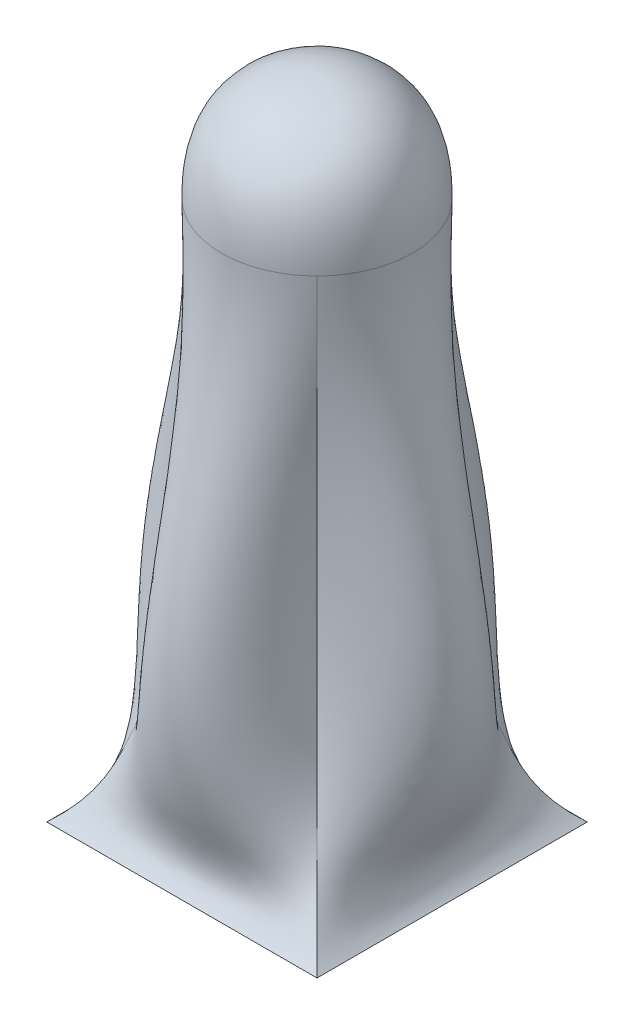
ISO-10303-21;
HEADER;
FILE_DESCRIPTION(('STEP AP214'),'2;1');
FILE_NAME('part.step','',(''),(''),'','','');
FILE_SCHEMA(('AUTOMOTIVE_DESIGN { 1 0 10303 214 1 1 1 1 }'));
ENDSEC;
DATA;
#1=APPLICATION_CONTEXT('core data for automotive mechanical design processes');
#2=APPLICATION_PROTOCOL_DEFINITION('international standard','automotive_design',2000,#1);
#3=PRODUCT_CONTEXT('',#1,'mechanical');
#4=PRODUCT('Part','Part','',(#3));
#5=PRODUCT_RELATED_PRODUCT_CATEGORY('part','',(#4));
#6=PRODUCT_DEFINITION_FORMATION('','',#4);
#7=PRODUCT_DEFINITION_CONTEXT('part definition',#1,'design');
#8=PRODUCT_DEFINITION('design','',#6,#7);
#9=PRODUCT_DEFINITION_SHAPE('','',#8);
#10=(LENGTH_UNIT() NAMED_UNIT(*) SI_UNIT(.MILLI.,.METRE.));
#11=(NAMED_UNIT(*) PLANE_ANGLE_UNIT() SI_UNIT($,.RADIAN.));
#12=(NAMED_UNIT(*) SI_UNIT($,.STERADIAN.) SOLID_ANGLE_UNIT());
#13=UNCERTAINTY_MEASURE_WITH_UNIT(LENGTH_MEASURE(1.E-05),#10,'distance_accuracy_value','');
#14=(GEOMETRIC_REPRESENTATION_CONTEXT(3) GLOBAL_UNCERTAINTY_ASSIGNED_CONTEXT((#13)) GLOBAL_UNIT_ASSIGNED_CONTEXT((#10,
#11,#12)) REPRESENTATION_CONTEXT('',''));
#15=CARTESIAN_POINT('',(0.,0.,0.));
#16=DIRECTION('',(0.,0.,1.));
#17=DIRECTION('',(1.,0.,0.));
#18=AXIS2_PLACEMENT_3D('',#15,#16,#17);
#19=CARTESIAN_POINT('',(0.,0.,0.));
#20=DIRECTION('',(0.,1.,0.));
#21=DIRECTION('',(0.,0.,1.));
#22=AXIS2_PLACEMENT_3D('',#19,#20,#21);
#23=PLANE('',#22);
#24=DIRECTION('',(0.,0.,-1.));
#25=VECTOR('',#24,1.);
#26=CARTESIAN_POINT('',(6.35,0.,-6.35));
#27=LINE('',#26,#25);
#28=CARTESIAN_POINT('',(6.35,0.,6.35));
#29=VERTEX_POINT('',#28);
#30=CARTESIAN_POINT('',(6.35,0.,-6.35));
#31=VERTEX_POINT('',#30);
#32=EDGE_CURVE('E311',#29,#31,#27,.T.);
#33=ORIENTED_EDGE('',*,*,#32,.F.);
#34=DIRECTION('',(1.,0.,0.));
#35=VECTOR('',#34,1.);
#36=CARTESIAN_POINT('',(-6.35,0.,6.35));
#37=LINE('',#36,#35);
#38=CARTESIAN_POINT('',(-6.35,0.,6.35));
#39=VERTEX_POINT('',#38);
#40=EDGE_CURVE('E270',#39,#29,#37,.T.);
#41=ORIENTED_EDGE('',*,*,#40,.F.);
#42=DIRECTION('',(0.,0.,1.));
#43=VECTOR('',#42,1.);
#44=CARTESIAN_POINT('',(-6.35,0.,-6.35));
#45=LINE('',#44,#43);
#46=CARTESIAN_POINT('',(-6.35,0.,-6.35));
#47=VERTEX_POINT('',#46);
#48=EDGE_CURVE('E249',#47,#39,#45,.T.);
#49=ORIENTED_EDGE('',*,*,#48,.F.);
#50=DIRECTION('',(-1.,0.,0.));
#51=VECTOR('',#50,1.);
#52=CARTESIAN_POINT('',(-6.35,0.,-6.35));
#53=LINE('',#52,#51);
#54=EDGE_CURVE('E258',#31,#47,#53,.T.);
#55=ORIENTED_EDGE('',*,*,#54,.F.);
#56=EDGE_LOOP('',(#33,#41,#49,#55));
#57=FACE_BOUND('',#56,.T.);
#58=ADVANCED_FACE('F199',(#57),#23,.F.);
#59=CARTESIAN_POINT('',(6.35,0.,-6.35));
#60=CARTESIAN_POINT('',(5.25715478721967,0.940111358427036,-5.25715478721967));
#61=CARTESIAN_POINT('',(2.2564932928247,8.80242767633225,-2.2564932928247));
#62=CARTESIAN_POINT('',(3.14048812055301,17.8734446917604,-3.140488120553));
#63=CARTESIAN_POINT('',(3.175,25.4,-3.175));
#64=CARTESIAN_POINT('',(2.11666666666667,0.,-6.35));
#65=CARTESIAN_POINT('',(1.75238492907322,0.940111358427036,-5.25715478721967));
#66=CARTESIAN_POINT('',(2.8543690276463,8.80242767633225,-12.3673562099801));
#67=CARTESIAN_POINT('',(1.41116588367849,17.8734446917604,-4.89281827705885));
#68=CARTESIAN_POINT('',(1.42266984349416,25.4,-4.92733015650584));
#69=CARTESIAN_POINT('',(-2.11666666666667,0.,-6.35));
#70=CARTESIAN_POINT('',(-1.75238492907322,0.940111358427036,-5.25715478721967));
#71=CARTESIAN_POINT('',(-2.8543690276463,8.80242767633225,-12.3673562099801));
#72=CARTESIAN_POINT('',(-1.41116588367849,17.8734446917604,-4.89281827705885));
#73=CARTESIAN_POINT('',(-1.42266984349416,25.4,-4.92733015650584));
#74=CARTESIAN_POINT('',(-6.35,0.,-6.35));
#75=CARTESIAN_POINT('',(-5.25715478721967,0.940111358427036,-5.25715478721967));
#76=CARTESIAN_POINT('',(-2.2564932928247,8.80242767633225,-2.2564932928247));
#77=CARTESIAN_POINT('',(-3.140488120553,17.8734446917604,-3.14048812055301));
#78=CARTESIAN_POINT('',(-3.175,25.4,-3.175));
#79=B_SPLINE_SURFACE_WITH_KNOTS('',3,3,((#59,#60,#61,#62,#63),(#64,#65,#66,#67,#68),(#69,#70,
#71,#72,#73),(#74,#75,#76,#77,#78)),.UNSPECIFIED.,.F.,.F.,.F.,(4,4),(4,1,4),(0.,1.),(0.,
0.140606925971283,1.),.UNSPECIFIED.);
#80=CARTESIAN_POINT('',(-6.35,0.,-6.35));
#81=CARTESIAN_POINT('',(-5.25715478721967,0.940111358427036,-5.25715478721967));
#82=CARTESIAN_POINT('',(-2.2564932928247,8.80242767633225,-2.2564932928247));
#83=CARTESIAN_POINT('',(-3.140488120553,17.8734446917604,-3.14048812055301));
#84=CARTESIAN_POINT('',(-3.175,25.4,-3.175));
#85=B_SPLINE_CURVE_WITH_KNOTS('',3,(#80,#81,#82,#83,#84),.UNSPECIFIED.,.F.,.F.,(4,1,4),(0.,
0.140606925971283,1.),.UNSPECIFIED.);
#86=CARTESIAN_POINT('',(-3.17495555802655,25.400029660202,-3.17495555831719));
#87=VERTEX_POINT('',#86);
#88=EDGE_CURVE('E244',#47,#87,#85,.T.);
#89=CARTESIAN_POINT('',(0.,25.4,0.));
#90=DIRECTION('',(0.,1.,0.));
#91=DIRECTION('',(0.,0.,1.));
#92=AXIS2_PLACEMENT_3D('',#89,#90,#91);
#93=CIRCLE('',#92,4.49012806053458);
#94=CARTESIAN_POINT('',(3.17495555859003,25.400029660206,-3.17495555779246));
#95=VERTEX_POINT('',#94);
#96=EDGE_CURVE('E212',#95,#87,#93,.T.);
#97=CARTESIAN_POINT('',(6.35,0.,-6.35));
#98=CARTESIAN_POINT('',(5.25715478721967,0.940111358427036,-5.25715478721967));
#99=CARTESIAN_POINT('',(2.2564932928247,8.80242767633225,-2.2564932928247));
#100=CARTESIAN_POINT('',(3.14048812055301,17.8734446917604,-3.140488120553));
#101=CARTESIAN_POINT('',(3.175,25.4,-3.175));
#102=B_SPLINE_CURVE_WITH_KNOTS('',3,(#97,#98,#99,#100,#101),.UNSPECIFIED.,.F.,.F.,(4,1,4),(0.,
0.140606925971283,1.),.UNSPECIFIED.);
#103=EDGE_CURVE('E255',#95,#31,#102,.F.);
#104=ORIENTED_EDGE('',*,*,#54,.T.);
#105=ORIENTED_EDGE('',*,*,#88,.T.);
#106=ORIENTED_EDGE('',*,*,#96,.F.);
#107=ORIENTED_EDGE('',*,*,#103,.T.);
#108=EDGE_LOOP('',(#104,#105,#106,#107));
#109=FACE_BOUND('',#108,.T.);
#110=ADVANCED_FACE('F260',(#109),#79,.T.);
#111=CARTESIAN_POINT('',(-6.35,0.,-6.35));
#112=CARTESIAN_POINT('',(-5.25715478721967,0.940111358427036,-5.25715478721967));
#113=CARTESIAN_POINT('',(-2.2564932928247,8.80242767633225,-2.2564932928247));
#114=CARTESIAN_POINT('',(-3.140488120553,17.8734446917604,-3.14048812055301));
#115=CARTESIAN_POINT('',(-3.175,25.4,-3.175));
#116=CARTESIAN_POINT('',(-6.35,0.,-2.11666666666667));
#117=CARTESIAN_POINT('',(-5.25715478721967,0.940111358427036,-1.75238492907322));
#118=CARTESIAN_POINT('',(-12.3673562099801,8.80242767633225,-2.8543690276463));
#119=CARTESIAN_POINT('',(-4.89281827705885,17.8734446917604,-1.41116588367849));
#120=CARTESIAN_POINT('',(-4.92733015650584,25.4,-1.42266984349416));
#121=CARTESIAN_POINT('',(-6.35,0.,2.11666666666667));
#122=CARTESIAN_POINT('',(-5.25715478721967,0.940111358427036,1.75238492907322));
#123=CARTESIAN_POINT('',(-12.3673562099801,8.80242767633225,2.85436902764629));
#124=CARTESIAN_POINT('',(-4.89281827705885,17.8734446917604,1.41116588367849));
#125=CARTESIAN_POINT('',(-4.92733015650584,25.4,1.42266984349416));
#126=CARTESIAN_POINT('',(-6.35,0.,6.35));
#127=CARTESIAN_POINT('',(-5.25715478721967,0.940111358427036,5.25715478721967));
#128=CARTESIAN_POINT('',(-2.2564932928247,8.80242767633225,2.2564932928247));
#129=CARTESIAN_POINT('',(-3.14048812055301,17.8734446917604,3.140488120553));
#130=CARTESIAN_POINT('',(-3.175,25.4,3.175));
#131=B_SPLINE_SURFACE_WITH_KNOTS('',3,3,((#111,#112,#113,#114,#115),(#116,#117,#118,#119,#120),
(#121,#122,#123,#124,#125),(#126,#127,#128,#129,#130)),.UNSPECIFIED.,.F.,.F.,.F.,(4,4),(4,1,4),
(0.,1.),(0.,0.140606925971283,1.),.UNSPECIFIED.);
#132=CARTESIAN_POINT('',(-6.35,0.,6.35));
#133=CARTESIAN_POINT('',(-5.25715478721967,0.940111358427036,5.25715478721967));
#134=CARTESIAN_POINT('',(-2.2564932928247,8.80242767633225,2.2564932928247));
#135=CARTESIAN_POINT('',(-3.14048812055301,17.8734446917604,3.140488120553));
#136=CARTESIAN_POINT('',(-3.175,25.4,3.175));
#137=B_SPLINE_CURVE_WITH_KNOTS('',3,(#132,#133,#134,#135,#136),.UNSPECIFIED.,.F.,.F.,(4,1,4),
(0.,0.140606925971283,1.),.UNSPECIFIED.);
#138=CARTESIAN_POINT('',(-3.17495555722269,25.400029660181,3.17495555755255));
#139=VERTEX_POINT('',#138);
#140=EDGE_CURVE('E254',#39,#139,#137,.T.);
#141=EDGE_CURVE('E223',#87,#139,#93,.T.);
#142=ORIENTED_EDGE('',*,*,#48,.T.);
#143=ORIENTED_EDGE('',*,*,#140,.T.);
#144=ORIENTED_EDGE('',*,*,#141,.F.);
#145=ORIENTED_EDGE('',*,*,#88,.F.);
#146=EDGE_LOOP('',(#142,#143,#144,#145));
#147=FACE_BOUND('',#146,.T.);
#148=ADVANCED_FACE('F246',(#147),#131,.T.);
#149=CARTESIAN_POINT('',(6.35,0.,6.35));
#150=CARTESIAN_POINT('',(5.25715478721967,0.940111358427036,5.25715478721967));
#151=CARTESIAN_POINT('',(2.2564932928247,8.80242767633225,2.2564932928247));
#152=CARTESIAN_POINT('',(3.14048812055301,17.8734446917604,3.14048812055301));
#153=CARTESIAN_POINT('',(3.175,25.4,3.175));
#154=CARTESIAN_POINT('',(6.35,0.,2.11666666666667));
#155=CARTESIAN_POINT('',(5.25715478721967,0.940111358427036,1.75238492907322));
#156=CARTESIAN_POINT('',(12.3673562099801,8.80242767633225,2.8543690276463));
#157=CARTESIAN_POINT('',(4.89281827705885,17.8734446917604,1.41116588367849));
#158=CARTESIAN_POINT('',(4.92733015650584,25.4,1.42266984349416));
#159=CARTESIAN_POINT('',(6.35,0.,-2.11666666666667));
#160=CARTESIAN_POINT('',(5.25715478721967,0.940111358427036,-1.75238492907322));
#161=CARTESIAN_POINT('',(12.3673562099801,8.80242767633225,-2.8543690276463));
#162=CARTESIAN_POINT('',(4.89281827705885,17.8734446917604,-1.41116588367849));
#163=CARTESIAN_POINT('',(4.92733015650584,25.4,-1.42266984349416));
#164=CARTESIAN_POINT('',(6.35,0.,-6.35));
#165=CARTESIAN_POINT('',(5.25715478721967,0.940111358427036,-5.25715478721967));
#166=CARTESIAN_POINT('',(2.2564932928247,8.80242767633225,-2.2564932928247));
#167=CARTESIAN_POINT('',(3.14048812055301,17.8734446917604,-3.14048812055301));
#168=CARTESIAN_POINT('',(3.175,25.4,-3.175));
#169=B_SPLINE_SURFACE_WITH_KNOTS('',3,3,((#149,#150,#151,#152,#153),(#154,#155,#156,#157,#158),
(#159,#160,#161,#162,#163),(#164,#165,#166,#167,#168)),.UNSPECIFIED.,.F.,.F.,.F.,(4,4),(4,1,4),
(0.,1.),(0.,0.140606925971283,1.),.UNSPECIFIED.);
#170=CARTESIAN_POINT('',(3.17495555789899,25.4000296601977,3.1749555581545));
#171=VERTEX_POINT('',#170);
#172=EDGE_CURVE('E13',#171,#95,#93,.T.);
#173=CARTESIAN_POINT('',(6.35,0.,6.35));
#174=CARTESIAN_POINT('',(5.25715478721967,0.940111358427036,5.25715478721967));
#175=CARTESIAN_POINT('',(2.2564932928247,8.80242767633225,2.2564932928247));
#176=CARTESIAN_POINT('',(3.140488120553,17.8734446917604,3.14048812055301));
#177=CARTESIAN_POINT('',(3.175,25.4,3.175));
#178=B_SPLINE_CURVE_WITH_KNOTS('',3,(#173,#174,#175,#176,#177),.UNSPECIFIED.,.F.,.F.,(4,1,4),
(0.,0.140606925971283,1.),.UNSPECIFIED.);
#179=EDGE_CURVE('E364',#29,#171,#178,.T.);
#180=ORIENTED_EDGE('',*,*,#32,.T.);
#181=ORIENTED_EDGE('',*,*,#103,.F.);
#182=ORIENTED_EDGE('',*,*,#172,.F.);
#183=ORIENTED_EDGE('',*,*,#179,.F.);
#184=EDGE_LOOP('',(#180,#181,#182,#183));
#185=FACE_BOUND('',#184,.T.);
#186=ADVANCED_FACE('F388',(#185),#169,.T.);
#187=CARTESIAN_POINT('',(-6.35,0.,6.35));
#188=CARTESIAN_POINT('',(-5.25715478721967,0.940111358427036,5.25715478721967));
#189=CARTESIAN_POINT('',(-2.2564932928247,8.80242767633225,2.2564932928247));
#190=CARTESIAN_POINT('',(-3.14048812055301,17.8734446917604,3.140488120553));
#191=CARTESIAN_POINT('',(-3.175,25.4,3.175));
#192=CARTESIAN_POINT('',(-2.11666666666667,0.,6.35));
#193=CARTESIAN_POINT('',(-1.75238492907322,0.940111358427036,5.25715478721967));
#194=CARTESIAN_POINT('',(-2.8543690276463,8.80242767633225,12.3673562099801));
#195=CARTESIAN_POINT('',(-1.41116588367849,17.8734446917604,4.89281827705885));
#196=CARTESIAN_POINT('',(-1.42266984349416,25.4,4.92733015650584));
#197=CARTESIAN_POINT('',(2.11666666666667,0.,6.35));
#198=CARTESIAN_POINT('',(1.75238492907322,0.940111358427036,5.25715478721967));
#199=CARTESIAN_POINT('',(2.85436902764629,8.80242767633225,12.3673562099801));
#200=CARTESIAN_POINT('',(1.41116588367849,17.8734446917604,4.89281827705885));
#201=CARTESIAN_POINT('',(1.42266984349416,25.4,4.92733015650584));
#202=CARTESIAN_POINT('',(6.35,0.,6.35));
#203=CARTESIAN_POINT('',(5.25715478721967,0.940111358427036,5.25715478721967));
#204=CARTESIAN_POINT('',(2.2564932928247,8.80242767633225,2.2564932928247));
#205=CARTESIAN_POINT('',(3.140488120553,17.8734446917604,3.14048812055301));
#206=CARTESIAN_POINT('',(3.175,25.4,3.175));
#207=B_SPLINE_SURFACE_WITH_KNOTS('',3,3,((#187,#188,#189,#190,#191),(#192,#193,#194,#195,#196),
(#197,#198,#199,#200,#201),(#202,#203,#204,#205,#206)),.UNSPECIFIED.,.F.,.F.,.F.,(4,4),(4,1,4),
(0.,1.),(0.,0.140606925971283,1.),.UNSPECIFIED.);
#208=EDGE_CURVE('E206',#139,#171,#93,.T.);
#209=ORIENTED_EDGE('',*,*,#40,.T.);
#210=ORIENTED_EDGE('',*,*,#179,.T.);
#211=ORIENTED_EDGE('',*,*,#208,.F.);
#212=ORIENTED_EDGE('',*,*,#140,.F.);
#213=EDGE_LOOP('',(#209,#210,#211,#212));
#214=FACE_BOUND('',#213,.T.);
#215=ADVANCED_FACE('F398',(#214),#207,.T.);
#216=CARTESIAN_POINT('',(-2.58393824135666,19.6188464929194,-2.58393823402052));
#217=CARTESIAN_POINT('',(-2.98216835308657,21.0632158022008,-2.63611417585099));
#218=CARTESIAN_POINT('',(-3.36770386477029,22.2670436251259,-2.544340817138));
#219=CARTESIAN_POINT('',(-3.72683092063885,23.2308570478573,-2.29955298311802));
#220=CARTESIAN_POINT('',(-4.3115469555626,24.676099207138,-1.50400426332438));
#221=CARTESIAN_POINT('',(-4.5370821337491,25.1574085473612,-0.319276589135831));
#222=CARTESIAN_POINT('',(-4.53708211785205,25.1574085469734,0.319276587583361));
#223=CARTESIAN_POINT('',(-4.31154696603897,24.6760992074566,1.50400426147139));
#224=CARTESIAN_POINT('',(-3.7268309115682,23.2308570477408,2.29955298465438));
#225=CARTESIAN_POINT('',(-3.3677038657031,22.2670436252001,2.54434081970723));
#226=CARTESIAN_POINT('',(-2.98216834209336,21.0632158022274,2.63611417820025));
#227=CARTESIAN_POINT('',(-2.58393823401676,19.6188464929204,2.5839382413604));
#228=CARTESIAN_POINT('',(-2.63611415470295,21.0632158022448,-2.98216834537871));
#229=CARTESIAN_POINT('',(-3.02437549900734,22.5085408468448,-3.02437550417161));
#230=CARTESIAN_POINT('',(-3.4050786697387,23.7131149242095,-2.91200638568158));
#231=CARTESIAN_POINT('',(-3.76672148701517,24.6779386045191,-2.63233462256973));
#232=CARTESIAN_POINT('',(-4.35871822776932,26.1245907617307,-1.72195919250978));
#233=CARTESIAN_POINT('',(-4.58693090550889,26.6064135388167,-0.365682364738586));
#234=CARTESIAN_POINT('',(-4.58693087004163,26.6064135382191,0.36568237281149));
#235=CARTESIAN_POINT('',(-4.35871826897776,26.124590762506,1.72195917032675));
#236=CARTESIAN_POINT('',(-3.7667214751146,24.677938604119,2.63233465169208));
#237=CARTESIAN_POINT('',(-3.40507867007648,23.7131149244419,2.91200631966121));
#238=CARTESIAN_POINT('',(-3.024375506745,22.5085408468904,3.02437553466959));
#239=CARTESIAN_POINT('',(-2.63611415748218,21.0632158021851,2.98216835416877));
#240=CARTESIAN_POINT('',(-2.54434088658304,22.2670436250068,-3.3677038433229));
#241=CARTESIAN_POINT('',(-2.9120065869491,23.7131149240513,-3.40507877451345));
#242=CARTESIAN_POINT('',(-3.27327218274557,24.9177993907457,-3.27327233038554));
#243=CARTESIAN_POINT('',(-3.63757654526784,25.8839920666264,-2.97195252353341));
#244=CARTESIAN_POINT('',(-4.21767179789489,27.3322296620682,-1.94621848549143));
#245=CARTESIAN_POINT('',(-4.42889288459787,27.8148741639903,-0.411782035246345));
#246=CARTESIAN_POINT('',(-4.42889263369132,27.8148741610083,0.411782059161698));
#247=CARTESIAN_POINT('',(-4.21767214683369,27.3322296645964,1.94621854852307));
#248=CARTESIAN_POINT('',(-3.63757632061723,25.8839920653054,2.97195245827043));
#249=CARTESIAN_POINT('',(-3.27327228693237,24.9177993911957,3.27327248112535));
#250=CARTESIAN_POINT('',(-2.9120065991102,23.7131149237744,3.40507878868371));
#251=CARTESIAN_POINT('',(-2.54434088526524,22.2670436249062,3.36770386624909));
#252=CARTESIAN_POINT('',(-2.29955294374028,23.2308570479115,-3.72683092634465));
#253=CARTESIAN_POINT('',(-2.6323345919223,24.6779386045157,-3.76672146284179));
#254=CARTESIAN_POINT('',(-2.97195252159263,25.8839920665676,-3.63757644290962));
#255=CARTESIAN_POINT('',(-3.2942558147151,26.8488856784537,-3.2942558283847));
#256=CARTESIAN_POINT('',(-3.78904961619889,28.299387289686,-2.1421766032534));
#257=CARTESIAN_POINT('',(-3.97853319923924,28.7828917113041,-0.454613002313722));
#258=CARTESIAN_POINT('',(-3.97853324982165,28.7828917105104,0.454613021851266));
#259=CARTESIAN_POINT('',(-3.78904945142763,28.2993872892245,2.14217655212746));
#260=CARTESIAN_POINT('',(-3.2942559407844,26.8488856791872,3.29425585748065));
#261=CARTESIAN_POINT('',(-2.97195252822567,25.8839920663398,3.6375762990797));
#262=CARTESIAN_POINT('',(-2.63233451864143,24.6779386044058,3.76672143537105));
#263=CARTESIAN_POINT('',(-2.29955293123009,23.230857048059,3.726830903578));
#264=CARTESIAN_POINT('',(-1.50400427509048,24.676099207039,-4.31154695477152));
#265=CARTESIAN_POINT('',(-1.72195906904245,26.1245907616502,-4.35871826402761));
#266=CARTESIAN_POINT('',(-1.94621870102118,27.33222966285,-4.21767183848665));
#267=CARTESIAN_POINT('',(-2.14217652038936,28.2993872903221,-3.78904964234611));
#268=CARTESIAN_POINT('',(-2.46160253790873,29.7513503717864,-2.46160249189422));
#269=CARTESIAN_POINT('',(-2.57675351183102,30.236647309416,-0.518152042673162));
#270=CARTESIAN_POINT('',(-2.57675350556822,30.2366473086123,0.518151962351276));
#271=CARTESIAN_POINT('',(-2.46160267299885,29.7513503729118,2.46160260942155));
#272=CARTESIAN_POINT('',(-2.14217634347577,28.2993872894887,3.78904954223223));
#273=CARTESIAN_POINT('',(-1.94621867893999,27.3322296623322,4.21767217531252));
#274=CARTESIAN_POINT('',(-1.72195917492269,26.1245907621645,4.35871823485878));
#275=CARTESIAN_POINT('',(-1.5040042989592,24.6760992069782,4.31154698101882));
#276=CARTESIAN_POINT('',(-0.319276575700484,25.1574085473546,-4.53708212079062));
#277=CARTESIAN_POINT('',(-0.365682488707985,26.6064135386804,-4.58693088145809));
#278=CARTESIAN_POINT('',(-0.411781866705094,27.8148741632287,-4.42889291297479));
#279=CARTESIAN_POINT('',(-0.454613068869881,28.7828917096485,-3.97853314811877));
#280=CARTESIAN_POINT('',(-0.518152033316836,30.2366473101849,-2.57675352592334));
#281=CARTESIAN_POINT('',(-0.54259875223724,30.7229007184492,-0.542598793267674));
#282=CARTESIAN_POINT('',(-0.542598693412483,30.7229007207115,0.542598950212616));
#283=CARTESIAN_POINT('',(-0.518152011849668,30.2366473083704,2.57675340851297));
#284=CARTESIAN_POINT('',(-0.454613192966733,28.7828917108808,3.9785331730778));
#285=CARTESIAN_POINT('',(-0.411781964915859,27.8148741632681,4.42889257966853));
#286=CARTESIAN_POINT('',(-0.365682401602118,26.6064135386076,4.58693092656601));
#287=CARTESIAN_POINT('',(-0.319276565409861,25.1574085473516,4.53708212039974));
#288=CARTESIAN_POINT('',(0.319276544558981,25.1574085471177,-4.53708211919206));
#289=CARTESIAN_POINT('',(0.365682365799663,26.6064135386093,-4.58693090361724));
#290=CARTESIAN_POINT('',(0.411782089364352,27.8148741615264,-4.42889256316873));
#291=CARTESIAN_POINT('',(0.454612981106902,28.7828917122573,-3.97853332243922));
#292=CARTESIAN_POINT('',(0.518152014009979,30.236647308355,-2.57675346891198));
#293=CARTESIAN_POINT('',(0.54259887290066,30.722900719605,-0.542598708589199));
#294=CARTESIAN_POINT('',(0.542598549417868,30.722900718602,0.542598546765281));
#295=CARTESIAN_POINT('',(0.518152109489307,30.2366473093594,2.5767535337862));
#296=CARTESIAN_POINT('',(0.454613156494283,28.7828917109766,3.97853336921503));
#297=CARTESIAN_POINT('',(0.411781986962979,27.8148741625231,4.42889276889346));
#298=CARTESIAN_POINT('',(0.365682405490823,26.6064135379258,4.58693089183258));
#299=CARTESIAN_POINT('',(0.319276563084228,25.1574085469324,4.53708209450513));
#300=CARTESIAN_POINT('',(1.50400430617003,24.6760992072306,-4.31154698748761));
#301=CARTESIAN_POINT('',(1.72195917686588,26.1245907614809,-4.3587182866226));
#302=CARTESIAN_POINT('',(1.94621853285437,27.3322296658404,-4.21767215721239));
#303=CARTESIAN_POINT('',(2.14217659184872,28.2993872871733,-3.78904943923851));
#304=CARTESIAN_POINT('',(2.46160258403188,29.7513503739781,-2.46160259995969));
#305=CARTESIAN_POINT('',(2.57675343955808,30.236647309055,-0.518152098899738));
#306=CARTESIAN_POINT('',(2.57675356638022,30.2366473089561,0.518152197208656));
#307=CARTESIAN_POINT('',(2.46160257401469,29.7513503731328,2.46160254684922));
#308=CARTESIAN_POINT('',(2.14217641839527,28.2993872890861,3.78904943755737));
#309=CARTESIAN_POINT('',(1.94621866621347,27.3322296632789,4.21767205203417));
#310=CARTESIAN_POINT('',(1.72195914288756,26.1245907626841,4.3587182701615));
#311=CARTESIAN_POINT('',(1.50400430025577,24.6760992073272,4.31154701350372));
#312=CARTESIAN_POINT('',(2.29955294112172,23.2308570480119,-3.72683088326282));
#313=CARTESIAN_POINT('',(2.63233456803148,24.6779386053947,-3.76672138779053));
#314=CARTESIAN_POINT('',(2.9719525521677,25.8839920631008,-3.63757632790205));
#315=CARTESIAN_POINT('',(3.29425578550427,26.8488856808482,-3.29425591825607));
#316=CARTESIAN_POINT('',(3.78904956159463,28.2993872882085,-2.14217646328362));
#317=CARTESIAN_POINT('',(3.97853319590944,28.7828917104585,-0.454613050678652));
#318=CARTESIAN_POINT('',(3.9785332985287,28.7828917119328,0.454613011660095));
#319=CARTESIAN_POINT('',(3.7890494869319,28.2993872880605,2.14217648635163));
#320=CARTESIAN_POINT('',(3.29425586912424,26.8488856794128,3.29425592502546));
#321=CARTESIAN_POINT('',(2.97195254327733,25.8839920658025,3.6375763219829));
#322=CARTESIAN_POINT('',(2.63233455203792,24.6779386040532,3.76672143082424));
#323=CARTESIAN_POINT('',(2.29955292781118,23.2308570478923,3.72683086228517));
#324=CARTESIAN_POINT('',(2.54434087119661,22.267043624565,-3.36770389491949));
#325=CARTESIAN_POINT('',(2.91200652567521,23.7131149224701,-3.40507890849622));
#326=CARTESIAN_POINT('',(3.27327235986032,24.9177993948246,-3.27327228998212));
#327=CARTESIAN_POINT('',(3.63757641006393,25.8839920640441,-2.97195251774443));
#328=CARTESIAN_POINT('',(4.21767211089237,27.332229665108,-1.94621857842596));
#329=CARTESIAN_POINT('',(4.42889266494419,27.8148741620964,-0.411782101119189));
#330=CARTESIAN_POINT('',(4.42889275652331,27.814874162014,0.411782119339433));
#331=CARTESIAN_POINT('',(4.21767200848441,27.3322296651255,1.9462185546536));
#332=CARTESIAN_POINT('',(3.63757642891006,25.8839920652194,2.97195252695515));
#333=CARTESIAN_POINT('',(3.27327224316436,24.9177993920692,3.2732723010804));
#334=CARTESIAN_POINT('',(2.91200659093865,23.7131149243337,3.40507887578594));
#335=CARTESIAN_POINT('',(2.54434089520771,22.2670436249704,3.36770389685856));
#336=CARTESIAN_POINT('',(2.63611415952114,21.0632158022479,-2.98216835285602));
#337=CARTESIAN_POINT('',(3.02437550161021,22.5085408468588,-3.02437543165431));
#338=CARTESIAN_POINT('',(3.40507866196651,23.7131149240068,-2.91200653189531));
#339=CARTESIAN_POINT('',(3.76672147314906,24.6779386044421,-2.63233454619585));
#340=CARTESIAN_POINT('',(4.35871822823895,26.1245907619407,-1.72195919102749));
#341=CARTESIAN_POINT('',(4.58693089482926,26.6064135381735,-0.365682376983324));
#342=CARTESIAN_POINT('',(4.58693088615422,26.6064135391001,0.365682362121269));
#343=CARTESIAN_POINT('',(4.35871823793578,26.1245907607546,1.72195920695688));
#344=CARTESIAN_POINT('',(3.76672148516451,24.6779386050315,2.63233452746026));
#345=CARTESIAN_POINT('',(3.40507867007546,23.7131149233433,2.91200656522641));
#346=CARTESIAN_POINT('',(3.02437550902706,22.5085408468419,3.02437541475192));
#347=CARTESIAN_POINT('',(2.63611416019941,21.063215802257,2.9821683448271));
#348=CARTESIAN_POINT('',(2.58393823401429,19.618846492925,-2.58393824136343));
#349=CARTESIAN_POINT('',(2.98216834151282,21.0632158022038,-2.63611413361177));
#350=CARTESIAN_POINT('',(3.36770385925287,22.2670436250186,-2.54434084469894));
#351=CARTESIAN_POINT('',(3.72683091489498,23.2308570479167,-2.29955295411241));
#352=CARTESIAN_POINT('',(4.31154695062447,24.6760992071609,-1.50400429996884));
#353=CARTESIAN_POINT('',(4.53708212413878,25.1574085470778,-0.319276518309295));
#354=CARTESIAN_POINT('',(4.53708213970897,25.1574085472676,0.319276519959815));
#355=CARTESIAN_POINT('',(4.31154694101835,24.6760992069644,1.50400430149196));
#356=CARTESIAN_POINT('',(3.7268309243457,23.2308570479561,2.29955295377374));
#357=CARTESIAN_POINT('',(3.3677038593983,22.2670436249619,2.54434084130904));
#358=CARTESIAN_POINT('',(2.98216835267723,21.0632158022159,2.63611413129879));
#359=CARTESIAN_POINT('',(2.58393824135948,19.6188464929403,2.58393823402148));
#360=B_SPLINE_SURFACE_WITH_KNOTS('',5,5,((#216,#217,#218,#219,#220,#221,#222,#223,#224,#225,
#226,#227),(#228,#229,#230,#231,#232,#233,#234,#235,#236,#237,#238,#239),(#240,#241,#242,#243,
#244,#245,#246,#247,#248,#249,#250,#251),(#252,#253,#254,#255,#256,#257,#258,#259,#260,#261,
#262,#263),(#264,#265,#266,#267,#268,#269,#270,#271,#272,#273,#274,#275),(#276,#277,#278,#279,
#280,#281,#282,#283,#284,#285,#286,#287),(#288,#289,#290,#291,#292,#293,#294,#295,#296,#297,
#298,#299),(#300,#301,#302,#303,#304,#305,#306,#307,#308,#309,#310,#311),(#312,#313,#314,#315,
#316,#317,#318,#319,#320,#321,#322,#323),(#324,#325,#326,#327,#328,#329,#330,#331,#332,#333,
#334,#335),(#336,#337,#338,#339,#340,#341,#342,#343,#344,#345,#346,#347),(#348,#349,#350,#351,
#352,#353,#354,#355,#356,#357,#358,#359)),.UNSPECIFIED.,.F.,.F.,.F.,(6,3,3,6),(6,3,3,6),
(-4.64742422383398,-1.54914140794441,1.54914140794517,4.64742422383475),(-4.64742422383471,
-1.54914140794523,1.54914140794425,4.64742422383373),.UNSPECIFIED.);
#361=ORIENTED_EDGE('',*,*,#172,.T.);
#362=ORIENTED_EDGE('',*,*,#96,.T.);
#363=ORIENTED_EDGE('',*,*,#141,.T.);
#364=ORIENTED_EDGE('',*,*,#208,.T.);
#365=EDGE_LOOP('',(#361,#362,#363,#364));
#366=FACE_BOUND('',#365,.T.);
#367=ADVANCED_FACE('F201',(#366),#360,.F.);
#368=CLOSED_SHELL('',(#58,#110,#148,#186,#215,#367));
#369=MANIFOLD_SOLID_BREP('B2',#368);
#370=ADVANCED_BREP_SHAPE_REPRESENTATION('',(#18,#369),#14);
#371=SHAPE_DEFINITION_REPRESENTATION(#9,#370);
ENDSEC;
END-ISO-10303-21;
